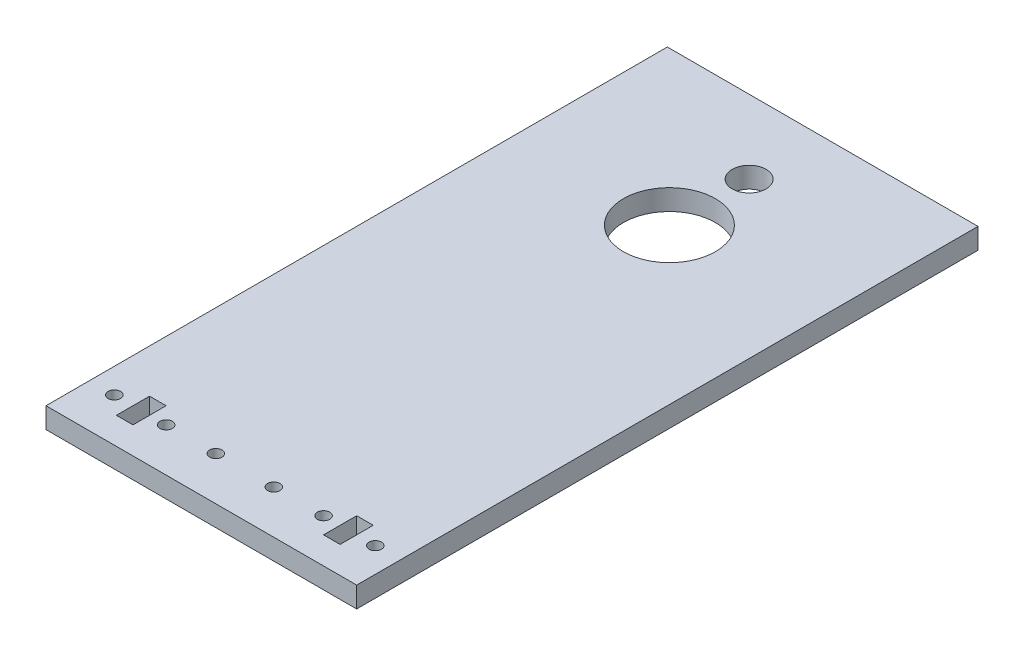
ISO-10303-21;
HEADER;
FILE_DESCRIPTION(('STEP AP214'),'2;1');
FILE_NAME('part.step','',(''),(''),'','','');
FILE_SCHEMA(('AUTOMOTIVE_DESIGN { 1 0 10303 214 1 1 1 1 }'));
ENDSEC;
DATA;
#1=APPLICATION_CONTEXT('core data for automotive mechanical design processes');
#2=APPLICATION_PROTOCOL_DEFINITION('international standard','automotive_design',2000,#1);
#3=PRODUCT_CONTEXT('',#1,'mechanical');
#4=PRODUCT('Part','Part','',(#3));
#5=PRODUCT_RELATED_PRODUCT_CATEGORY('part','',(#4));
#6=PRODUCT_DEFINITION_FORMATION('','',#4);
#7=PRODUCT_DEFINITION_CONTEXT('part definition',#1,'design');
#8=PRODUCT_DEFINITION('design','',#6,#7);
#9=PRODUCT_DEFINITION_SHAPE('','',#8);
#10=(LENGTH_UNIT() NAMED_UNIT(*) SI_UNIT(.MILLI.,.METRE.));
#11=(NAMED_UNIT(*) PLANE_ANGLE_UNIT() SI_UNIT($,.RADIAN.));
#12=(NAMED_UNIT(*) SI_UNIT($,.STERADIAN.) SOLID_ANGLE_UNIT());
#13=UNCERTAINTY_MEASURE_WITH_UNIT(LENGTH_MEASURE(1.E-05),#10,'distance_accuracy_value','');
#14=(GEOMETRIC_REPRESENTATION_CONTEXT(3) GLOBAL_UNCERTAINTY_ASSIGNED_CONTEXT((#13)) GLOBAL_UNIT_ASSIGNED_CONTEXT((#10,
#11,#12)) REPRESENTATION_CONTEXT('',''));
#15=CARTESIAN_POINT('',(0.,0.,0.));
#16=DIRECTION('',(0.,0.,1.));
#17=DIRECTION('',(1.,0.,0.));
#18=AXIS2_PLACEMENT_3D('',#15,#16,#17);
#19=CARTESIAN_POINT('',(10.5,5.,0.));
#20=DIRECTION('',(-1.,0.,0.));
#21=DIRECTION('',(0.,0.,1.));
#22=AXIS2_PLACEMENT_3D('',#19,#20,#21);
#23=PLANE('',#22);
#24=DIRECTION('',(0.,0.,-1.));
#25=VECTOR('',#24,1.);
#26=CARTESIAN_POINT('',(10.5,0.,0.));
#27=LINE('',#26,#25);
#28=CARTESIAN_POINT('',(10.5,0.,-6.50000000000001));
#29=VERTEX_POINT('',#28);
#30=CARTESIAN_POINT('',(10.5,0.,-14.5));
#31=VERTEX_POINT('',#30);
#32=EDGE_CURVE('E229',#29,#31,#27,.T.);
#33=ORIENTED_EDGE('',*,*,#32,.T.);
#34=DIRECTION('',(0.,-1.,0.));
#35=VECTOR('',#34,1.);
#36=CARTESIAN_POINT('',(10.5,5.,-14.5));
#37=LINE('',#36,#35);
#38=CARTESIAN_POINT('',(10.5,5.,-14.5));
#39=VERTEX_POINT('',#38);
#40=EDGE_CURVE('E11',#39,#31,#37,.T.);
#41=ORIENTED_EDGE('',*,*,#40,.F.);
#42=DIRECTION('',(0.,0.,-1.));
#43=VECTOR('',#42,1.);
#44=CARTESIAN_POINT('',(10.5,5.,0.));
#45=LINE('',#44,#43);
#46=CARTESIAN_POINT('',(10.5,5.,-6.50000000000001));
#47=VERTEX_POINT('',#46);
#48=EDGE_CURVE('E148',#47,#39,#45,.T.);
#49=ORIENTED_EDGE('',*,*,#48,.F.);
#50=DIRECTION('',(0.,-1.,0.));
#51=VECTOR('',#50,1.);
#52=CARTESIAN_POINT('',(10.5,5.,-6.50000000000001));
#53=LINE('',#52,#51);
#54=EDGE_CURVE('E247',#47,#29,#53,.T.);
#55=ORIENTED_EDGE('',*,*,#54,.T.);
#56=EDGE_LOOP('',(#33,#41,#49,#55));
#57=FACE_BOUND('',#56,.T.);
#58=ADVANCED_FACE('F40',(#57),#23,.F.);
#59=CARTESIAN_POINT('',(0.,5.,-14.5));
#60=DIRECTION('',(0.,0.,-1.));
#61=DIRECTION('',(-1.,0.,0.));
#62=AXIS2_PLACEMENT_3D('',#59,#60,#61);
#63=PLANE('',#62);
#64=DIRECTION('',(1.,0.,0.));
#65=VECTOR('',#64,1.);
#66=CARTESIAN_POINT('',(0.,0.,-14.5));
#67=LINE('',#66,#65);
#68=CARTESIAN_POINT('',(14.5,0.,-14.5));
#69=VERTEX_POINT('',#68);
#70=EDGE_CURVE('E154',#31,#69,#67,.T.);
#71=ORIENTED_EDGE('',*,*,#70,.T.);
#72=DIRECTION('',(0.,-1.,0.));
#73=VECTOR('',#72,1.);
#74=CARTESIAN_POINT('',(14.5,5.,-14.5));
#75=LINE('',#74,#73);
#76=CARTESIAN_POINT('',(14.5,5.,-14.5));
#77=VERTEX_POINT('',#76);
#78=EDGE_CURVE('E51',#77,#69,#75,.T.);
#79=ORIENTED_EDGE('',*,*,#78,.F.);
#80=DIRECTION('',(1.,0.,0.));
#81=VECTOR('',#80,1.);
#82=CARTESIAN_POINT('',(0.,5.,-14.5));
#83=LINE('',#82,#81);
#84=EDGE_CURVE('E141',#39,#77,#83,.T.);
#85=ORIENTED_EDGE('',*,*,#84,.F.);
#86=ORIENTED_EDGE('',*,*,#40,.T.);
#87=EDGE_LOOP('',(#71,#79,#85,#86));
#88=FACE_BOUND('',#87,.T.);
#89=ADVANCED_FACE('F153',(#88),#63,.F.);
#90=CARTESIAN_POINT('',(14.5,5.,0.));
#91=DIRECTION('',(1.,0.,0.));
#92=DIRECTION('',(0.,0.,-1.));
#93=AXIS2_PLACEMENT_3D('',#90,#91,#92);
#94=PLANE('',#93);
#95=DIRECTION('',(0.,0.,1.));
#96=VECTOR('',#95,1.);
#97=CARTESIAN_POINT('',(14.5,0.,0.));
#98=LINE('',#97,#96);
#99=CARTESIAN_POINT('',(14.5,0.,-6.50000000000001));
#100=VERTEX_POINT('',#99);
#101=EDGE_CURVE('E101',#69,#100,#98,.T.);
#102=ORIENTED_EDGE('',*,*,#101,.T.);
#103=DIRECTION('',(0.,-1.,0.));
#104=VECTOR('',#103,1.);
#105=CARTESIAN_POINT('',(14.5,5.,-6.50000000000001));
#106=LINE('',#105,#104);
#107=CARTESIAN_POINT('',(14.5,5.,-6.50000000000001));
#108=VERTEX_POINT('',#107);
#109=EDGE_CURVE('E156',#108,#100,#106,.T.);
#110=ORIENTED_EDGE('',*,*,#109,.F.);
#111=DIRECTION('',(0.,0.,1.));
#112=VECTOR('',#111,1.);
#113=CARTESIAN_POINT('',(14.5,5.,0.));
#114=LINE('',#113,#112);
#115=EDGE_CURVE('E146',#77,#108,#114,.T.);
#116=ORIENTED_EDGE('',*,*,#115,.F.);
#117=ORIENTED_EDGE('',*,*,#78,.T.);
#118=EDGE_LOOP('',(#102,#110,#116,#117));
#119=FACE_BOUND('',#118,.T.);
#120=ADVANCED_FACE('F158',(#119),#94,.F.);
#121=CARTESIAN_POINT('',(64.5,5.,0.));
#122=DIRECTION('',(-1.,0.,0.));
#123=DIRECTION('',(0.,0.,1.));
#124=AXIS2_PLACEMENT_3D('',#121,#122,#123);
#125=PLANE('',#124);
#126=DIRECTION('',(0.,0.,-1.));
#127=VECTOR('',#126,1.);
#128=CARTESIAN_POINT('',(64.5,0.,0.));
#129=LINE('',#128,#127);
#130=CARTESIAN_POINT('',(64.5,0.,-6.50000000000002));
#131=VERTEX_POINT('',#130);
#132=CARTESIAN_POINT('',(64.5,0.,-14.5));
#133=VERTEX_POINT('',#132);
#134=EDGE_CURVE('E197',#131,#133,#129,.T.);
#135=ORIENTED_EDGE('',*,*,#134,.F.);
#136=DIRECTION('',(0.,-1.,0.));
#137=VECTOR('',#136,1.);
#138=CARTESIAN_POINT('',(64.5,5.,-6.50000000000002));
#139=LINE('',#138,#137);
#140=CARTESIAN_POINT('',(64.5,5.,-6.50000000000002));
#141=VERTEX_POINT('',#140);
#142=EDGE_CURVE('E250',#141,#131,#139,.T.);
#143=ORIENTED_EDGE('',*,*,#142,.F.);
#144=DIRECTION('',(0.,0.,-1.));
#145=VECTOR('',#144,1.);
#146=CARTESIAN_POINT('',(64.5,5.,0.));
#147=LINE('',#146,#145);
#148=CARTESIAN_POINT('',(64.5,5.,-14.5));
#149=VERTEX_POINT('',#148);
#150=EDGE_CURVE('E309',#141,#149,#147,.T.);
#151=ORIENTED_EDGE('',*,*,#150,.T.);
#152=DIRECTION('',(0.,-1.,0.));
#153=VECTOR('',#152,1.);
#154=CARTESIAN_POINT('',(64.5,5.,-14.5));
#155=LINE('',#154,#153);
#156=EDGE_CURVE('E253',#149,#133,#155,.T.);
#157=ORIENTED_EDGE('',*,*,#156,.T.);
#158=EDGE_LOOP('',(#135,#143,#151,#157));
#159=FACE_BOUND('',#158,.T.);
#160=ADVANCED_FACE('F422',(#159),#125,.T.);
#161=CARTESIAN_POINT('',(0.,5.,-6.50000000000002));
#162=DIRECTION('',(0.,0.,-1.));
#163=DIRECTION('',(-1.,0.,0.));
#164=AXIS2_PLACEMENT_3D('',#161,#162,#163);
#165=PLANE('',#164);
#166=DIRECTION('',(1.,0.,0.));
#167=VECTOR('',#166,1.);
#168=CARTESIAN_POINT('',(0.,0.,-6.50000000000002));
#169=LINE('',#168,#167);
#170=CARTESIAN_POINT('',(60.5,0.,-6.50000000000002));
#171=VERTEX_POINT('',#170);
#172=EDGE_CURVE('E201',#171,#131,#169,.T.);
#173=ORIENTED_EDGE('',*,*,#172,.F.);
#174=DIRECTION('',(0.,-1.,0.));
#175=VECTOR('',#174,1.);
#176=CARTESIAN_POINT('',(60.5,5.,-6.50000000000002));
#177=LINE('',#176,#175);
#178=CARTESIAN_POINT('',(60.5,5.,-6.50000000000002));
#179=VERTEX_POINT('',#178);
#180=EDGE_CURVE('E259',#179,#171,#177,.T.);
#181=ORIENTED_EDGE('',*,*,#180,.F.);
#182=DIRECTION('',(1.,0.,0.));
#183=VECTOR('',#182,1.);
#184=CARTESIAN_POINT('',(0.,5.,-6.50000000000002));
#185=LINE('',#184,#183);
#186=EDGE_CURVE('E313',#179,#141,#185,.T.);
#187=ORIENTED_EDGE('',*,*,#186,.T.);
#188=ORIENTED_EDGE('',*,*,#142,.T.);
#189=EDGE_LOOP('',(#173,#181,#187,#188));
#190=FACE_BOUND('',#189,.T.);
#191=ADVANCED_FACE('F418',(#190),#165,.T.);
#192=CARTESIAN_POINT('',(60.5,5.,0.));
#193=DIRECTION('',(1.,0.,0.));
#194=DIRECTION('',(0.,0.,-1.));
#195=AXIS2_PLACEMENT_3D('',#192,#193,#194);
#196=PLANE('',#195);
#197=DIRECTION('',(0.,0.,1.));
#198=VECTOR('',#197,1.);
#199=CARTESIAN_POINT('',(60.5,0.,0.));
#200=LINE('',#199,#198);
#201=CARTESIAN_POINT('',(60.5,0.,-14.5));
#202=VERTEX_POINT('',#201);
#203=EDGE_CURVE('E205',#202,#171,#200,.T.);
#204=ORIENTED_EDGE('',*,*,#203,.F.);
#205=DIRECTION('',(0.,-1.,0.));
#206=VECTOR('',#205,1.);
#207=CARTESIAN_POINT('',(60.5,5.,-14.5));
#208=LINE('',#207,#206);
#209=CARTESIAN_POINT('',(60.5,5.,-14.5));
#210=VERTEX_POINT('',#209);
#211=EDGE_CURVE('E256',#210,#202,#208,.T.);
#212=ORIENTED_EDGE('',*,*,#211,.F.);
#213=DIRECTION('',(0.,0.,1.));
#214=VECTOR('',#213,1.);
#215=CARTESIAN_POINT('',(60.5,5.,0.));
#216=LINE('',#215,#214);
#217=EDGE_CURVE('E317',#210,#179,#216,.T.);
#218=ORIENTED_EDGE('',*,*,#217,.T.);
#219=ORIENTED_EDGE('',*,*,#180,.T.);
#220=EDGE_LOOP('',(#204,#212,#218,#219));
#221=FACE_BOUND('',#220,.T.);
#222=ADVANCED_FACE('F415',(#221),#196,.T.);
#223=CARTESIAN_POINT('',(0.,5.,0.));
#224=DIRECTION('',(0.,0.,-1.));
#225=DIRECTION('',(-1.,0.,0.));
#226=AXIS2_PLACEMENT_3D('',#223,#224,#225);
#227=PLANE('',#226);
#228=DIRECTION('',(1.,0.,0.));
#229=VECTOR('',#228,1.);
#230=CARTESIAN_POINT('',(0.,0.,0.));
#231=LINE('',#230,#229);
#232=CARTESIAN_POINT('',(0.,0.,0.));
#233=VERTEX_POINT('',#232);
#234=CARTESIAN_POINT('',(75.,0.,0.));
#235=VERTEX_POINT('',#234);
#236=EDGE_CURVE('E176',#233,#235,#231,.T.);
#237=ORIENTED_EDGE('',*,*,#236,.T.);
#238=DIRECTION('',(0.,-1.,0.));
#239=VECTOR('',#238,1.);
#240=CARTESIAN_POINT('',(75.,5.,0.));
#241=LINE('',#240,#239);
#242=CARTESIAN_POINT('',(75.,5.,0.));
#243=VERTEX_POINT('',#242);
#244=EDGE_CURVE('E44',#243,#235,#241,.T.);
#245=ORIENTED_EDGE('',*,*,#244,.F.);
#246=DIRECTION('',(1.,0.,0.));
#247=VECTOR('',#246,1.);
#248=CARTESIAN_POINT('',(0.,5.,0.));
#249=LINE('',#248,#247);
#250=CARTESIAN_POINT('',(0.,5.,0.));
#251=VERTEX_POINT('',#250);
#252=EDGE_CURVE('E246',#251,#243,#249,.T.);
#253=ORIENTED_EDGE('',*,*,#252,.F.);
#254=DIRECTION('',(0.,-1.,0.));
#255=VECTOR('',#254,1.);
#256=CARTESIAN_POINT('',(0.,5.,0.));
#257=LINE('',#256,#255);
#258=EDGE_CURVE('E175',#251,#233,#257,.T.);
#259=ORIENTED_EDGE('',*,*,#258,.T.);
#260=EDGE_LOOP('',(#237,#245,#253,#259));
#261=FACE_BOUND('',#260,.T.);
#262=ADVANCED_FACE('F42',(#261),#227,.F.);
#263=CARTESIAN_POINT('',(75.,5.,0.));
#264=DIRECTION('',(-1.,0.,0.));
#265=DIRECTION('',(0.,0.,1.));
#266=AXIS2_PLACEMENT_3D('',#263,#264,#265);
#267=PLANE('',#266);
#268=DIRECTION('',(0.,0.,-1.));
#269=VECTOR('',#268,1.);
#270=CARTESIAN_POINT('',(75.,0.,0.));
#271=LINE('',#270,#269);
#272=CARTESIAN_POINT('',(75.,0.,-150.));
#273=VERTEX_POINT('',#272);
#274=EDGE_CURVE('E180',#235,#273,#271,.T.);
#275=ORIENTED_EDGE('',*,*,#274,.T.);
#276=DIRECTION('',(0.,-1.,0.));
#277=VECTOR('',#276,1.);
#278=CARTESIAN_POINT('',(75.,5.,-150.));
#279=LINE('',#278,#277);
#280=CARTESIAN_POINT('',(75.,5.,-150.));
#281=VERTEX_POINT('',#280);
#282=EDGE_CURVE('E270',#281,#273,#279,.T.);
#283=ORIENTED_EDGE('',*,*,#282,.F.);
#284=DIRECTION('',(0.,0.,-1.));
#285=VECTOR('',#284,1.);
#286=CARTESIAN_POINT('',(75.,5.,0.));
#287=LINE('',#286,#285);
#288=EDGE_CURVE('E116',#243,#281,#287,.T.);
#289=ORIENTED_EDGE('',*,*,#288,.F.);
#290=ORIENTED_EDGE('',*,*,#244,.T.);
#291=EDGE_LOOP('',(#275,#283,#289,#290));
#292=FACE_BOUND('',#291,.T.);
#293=ADVANCED_FACE('F277',(#292),#267,.F.);
#294=CARTESIAN_POINT('',(0.,5.,-150.));
#295=DIRECTION('',(0.,0.,1.));
#296=DIRECTION('',(1.,0.,0.));
#297=AXIS2_PLACEMENT_3D('',#294,#295,#296);
#298=PLANE('',#297);
#299=DIRECTION('',(-1.,0.,0.));
#300=VECTOR('',#299,1.);
#301=CARTESIAN_POINT('',(0.,0.,-150.));
#302=LINE('',#301,#300);
#303=CARTESIAN_POINT('',(0.,0.,-150.));
#304=VERTEX_POINT('',#303);
#305=EDGE_CURVE('E183',#273,#304,#302,.T.);
#306=ORIENTED_EDGE('',*,*,#305,.T.);
#307=DIRECTION('',(0.,-1.,0.));
#308=VECTOR('',#307,1.);
#309=CARTESIAN_POINT('',(0.,5.,-150.));
#310=LINE('',#309,#308);
#311=CARTESIAN_POINT('',(0.,5.,-150.));
#312=VERTEX_POINT('',#311);
#313=EDGE_CURVE('E267',#312,#304,#310,.T.);
#314=ORIENTED_EDGE('',*,*,#313,.F.);
#315=DIRECTION('',(-1.,0.,0.));
#316=VECTOR('',#315,1.);
#317=CARTESIAN_POINT('',(0.,5.,-150.));
#318=LINE('',#317,#316);
#319=EDGE_CURVE('E295',#281,#312,#318,.T.);
#320=ORIENTED_EDGE('',*,*,#319,.F.);
#321=ORIENTED_EDGE('',*,*,#282,.T.);
#322=EDGE_LOOP('',(#306,#314,#320,#321));
#323=FACE_BOUND('',#322,.T.);
#324=ADVANCED_FACE('F287',(#323),#298,.F.);
#325=CARTESIAN_POINT('',(30.5,5.,-10.5));
#326=DIRECTION('',(0.,-1.,0.));
#327=DIRECTION('',(0.,0.,-1.));
#328=AXIS2_PLACEMENT_3D('',#325,#326,#327);
#329=CYLINDRICAL_SURFACE('',#328,1.5);
#330=CARTESIAN_POINT('',(30.5,5.,-10.5));
#331=DIRECTION('',(0.,1.,0.));
#332=DIRECTION('',(0.,0.,1.));
#333=AXIS2_PLACEMENT_3D('',#330,#331,#332);
#334=CIRCLE('',#333,1.5);
#335=CARTESIAN_POINT('',(30.5,5.,-9.00000000000001));
#336=VERTEX_POINT('',#335);
#337=EDGE_CURVE('E164',#336,#336,#334,.F.);
#338=ORIENTED_EDGE('',*,*,#337,.F.);
#339=EDGE_LOOP('',(#338));
#340=FACE_BOUND('',#339,.T.);
#341=CARTESIAN_POINT('',(30.5,0.,-10.5));
#342=DIRECTION('',(0.,1.,0.));
#343=DIRECTION('',(0.,0.,1.));
#344=AXIS2_PLACEMENT_3D('',#341,#342,#343);
#345=CIRCLE('',#344,1.5);
#346=CARTESIAN_POINT('',(30.5,0.,-9.00000000000001));
#347=VERTEX_POINT('',#346);
#348=EDGE_CURVE('E238',#347,#347,#345,.F.);
#349=ORIENTED_EDGE('',*,*,#348,.T.);
#350=EDGE_LOOP('',(#349));
#351=FACE_BOUND('',#350,.T.);
#352=ADVANCED_FACE('F434',(#340,#351),#329,.F.);
#353=CARTESIAN_POINT('',(0.,5.,-6.50000000000001));
#354=DIRECTION('',(0.,0.,1.));
#355=DIRECTION('',(1.,0.,0.));
#356=AXIS2_PLACEMENT_3D('',#353,#354,#355);
#357=PLANE('',#356);
#358=DIRECTION('',(-1.,0.,0.));
#359=VECTOR('',#358,1.);
#360=CARTESIAN_POINT('',(0.,0.,-6.50000000000001));
#361=LINE('',#360,#359);
#362=EDGE_CURVE('E107',#100,#29,#361,.T.);
#363=ORIENTED_EDGE('',*,*,#362,.T.);
#364=ORIENTED_EDGE('',*,*,#54,.F.);
#365=DIRECTION('',(-1.,0.,0.));
#366=VECTOR('',#365,1.);
#367=CARTESIAN_POINT('',(0.,5.,-6.50000000000001));
#368=LINE('',#367,#366);
#369=EDGE_CURVE('E60',#108,#47,#368,.T.);
#370=ORIENTED_EDGE('',*,*,#369,.F.);
#371=ORIENTED_EDGE('',*,*,#109,.T.);
#372=EDGE_LOOP('',(#363,#364,#370,#371));
#373=FACE_BOUND('',#372,.T.);
#374=ADVANCED_FACE('F367',(#373),#357,.F.);
#375=CARTESIAN_POINT('',(18.5,5.,-10.5));
#376=DIRECTION('',(0.,-1.,0.));
#377=DIRECTION('',(0.,0.,-1.));
#378=AXIS2_PLACEMENT_3D('',#375,#376,#377);
#379=CYLINDRICAL_SURFACE('',#378,1.5);
#380=CARTESIAN_POINT('',(18.5,5.,-10.5));
#381=DIRECTION('',(0.,1.,0.));
#382=DIRECTION('',(0.,0.,1.));
#383=AXIS2_PLACEMENT_3D('',#380,#381,#382);
#384=CIRCLE('',#383,1.5);
#385=CARTESIAN_POINT('',(18.5,5.,-9.00000000000001));
#386=VERTEX_POINT('',#385);
#387=EDGE_CURVE('E336',#386,#386,#384,.F.);
#388=ORIENTED_EDGE('',*,*,#387,.F.);
#389=EDGE_LOOP('',(#388));
#390=FACE_BOUND('',#389,.T.);
#391=CARTESIAN_POINT('',(18.5,0.,-10.5));
#392=DIRECTION('',(0.,1.,0.));
#393=DIRECTION('',(0.,0.,1.));
#394=AXIS2_PLACEMENT_3D('',#391,#392,#393);
#395=CIRCLE('',#394,1.5);
#396=CARTESIAN_POINT('',(18.5,0.,-9.00000000000001));
#397=VERTEX_POINT('',#396);
#398=EDGE_CURVE('E225',#397,#397,#395,.F.);
#399=ORIENTED_EDGE('',*,*,#398,.T.);
#400=EDGE_LOOP('',(#399));
#401=FACE_BOUND('',#400,.T.);
#402=ADVANCED_FACE('F363',(#390,#401),#379,.F.);
#403=CARTESIAN_POINT('',(69.,5.,-10.5));
#404=DIRECTION('',(0.,-1.,0.));
#405=DIRECTION('',(0.,0.,-1.));
#406=AXIS2_PLACEMENT_3D('',#403,#404,#405);
#407=CYLINDRICAL_SURFACE('',#406,1.5);
#408=CARTESIAN_POINT('',(69.,5.,-10.5));
#409=DIRECTION('',(0.,1.,0.));
#410=DIRECTION('',(0.,0.,1.));
#411=AXIS2_PLACEMENT_3D('',#408,#409,#410);
#412=CIRCLE('',#411,1.5);
#413=CARTESIAN_POINT('',(69.,5.,-9.00000000000002));
#414=VERTEX_POINT('',#413);
#415=EDGE_CURVE('E332',#414,#414,#412,.T.);
#416=ORIENTED_EDGE('',*,*,#415,.T.);
#417=EDGE_LOOP('',(#416));
#418=FACE_BOUND('',#417,.T.);
#419=CARTESIAN_POINT('',(69.,0.,-10.5));
#420=DIRECTION('',(0.,1.,0.));
#421=DIRECTION('',(0.,0.,1.));
#422=AXIS2_PLACEMENT_3D('',#419,#420,#421);
#423=CIRCLE('',#422,1.5);
#424=CARTESIAN_POINT('',(69.,0.,-9.00000000000002));
#425=VERTEX_POINT('',#424);
#426=EDGE_CURVE('E221',#425,#425,#423,.T.);
#427=ORIENTED_EDGE('',*,*,#426,.F.);
#428=EDGE_LOOP('',(#427));
#429=FACE_BOUND('',#428,.T.);
#430=ADVANCED_FACE('F366',(#418,#429),#407,.F.);
#431=CARTESIAN_POINT('',(37.5,5.,-132.25));
#432=DIRECTION('',(0.,-1.,0.));
#433=DIRECTION('',(0.,0.,-1.));
#434=AXIS2_PLACEMENT_3D('',#431,#432,#433);
#435=CYLINDRICAL_SURFACE('',#434,4.1);
#436=CARTESIAN_POINT('',(37.5,5.,-132.25));
#437=DIRECTION('',(0.,1.,0.));
#438=DIRECTION('',(0.,0.,1.));
#439=AXIS2_PLACEMENT_3D('',#436,#437,#438);
#440=CIRCLE('',#439,4.1);
#441=CARTESIAN_POINT('',(37.5,5.,-128.15));
#442=VERTEX_POINT('',#441);
#443=EDGE_CURVE('E329',#442,#442,#440,.T.);
#444=ORIENTED_EDGE('',*,*,#443,.T.);
#445=EDGE_LOOP('',(#444));
#446=FACE_BOUND('',#445,.T.);
#447=CARTESIAN_POINT('',(37.5,0.,-132.25));
#448=DIRECTION('',(0.,1.,0.));
#449=DIRECTION('',(0.,0.,1.));
#450=AXIS2_PLACEMENT_3D('',#447,#448,#449);
#451=CIRCLE('',#450,4.1);
#452=CARTESIAN_POINT('',(37.5,0.,-128.15));
#453=VERTEX_POINT('',#452);
#454=EDGE_CURVE('E217',#453,#453,#451,.T.);
#455=ORIENTED_EDGE('',*,*,#454,.F.);
#456=EDGE_LOOP('',(#455));
#457=FACE_BOUND('',#456,.T.);
#458=ADVANCED_FACE('F401',(#446,#457),#435,.F.);
#459=CARTESIAN_POINT('',(37.5,5.,-113.));
#460=DIRECTION('',(0.,-1.,0.));
#461=DIRECTION('',(0.,0.,-1.));
#462=AXIS2_PLACEMENT_3D('',#459,#460,#461);
#463=CYLINDRICAL_SURFACE('',#462,11.1);
#464=CARTESIAN_POINT('',(37.5,5.,-113.));
#465=DIRECTION('',(0.,1.,0.));
#466=DIRECTION('',(0.,0.,1.));
#467=AXIS2_PLACEMENT_3D('',#464,#465,#466);
#468=CIRCLE('',#467,11.1);
#469=CARTESIAN_POINT('',(37.5,5.,-101.9));
#470=VERTEX_POINT('',#469);
#471=EDGE_CURVE('E325',#470,#470,#468,.T.);
#472=ORIENTED_EDGE('',*,*,#471,.T.);
#473=EDGE_LOOP('',(#472));
#474=FACE_BOUND('',#473,.T.);
#475=CARTESIAN_POINT('',(37.5,0.,-113.));
#476=DIRECTION('',(0.,1.,0.));
#477=DIRECTION('',(0.,0.,1.));
#478=AXIS2_PLACEMENT_3D('',#475,#476,#477);
#479=CIRCLE('',#478,11.1);
#480=CARTESIAN_POINT('',(37.5,0.,-101.9));
#481=VERTEX_POINT('',#480);
#482=EDGE_CURVE('E213',#481,#481,#479,.T.);
#483=ORIENTED_EDGE('',*,*,#482,.F.);
#484=EDGE_LOOP('',(#483));
#485=FACE_BOUND('',#484,.T.);
#486=ADVANCED_FACE('F405',(#474,#485),#463,.F.);
#487=CARTESIAN_POINT('',(0.,5.,-14.4999999999998));
#488=DIRECTION('',(0.,0.,1.));
#489=DIRECTION('',(1.,0.,0.));
#490=AXIS2_PLACEMENT_3D('',#487,#488,#489);
#491=PLANE('',#490);
#492=DIRECTION('',(-1.,0.,0.));
#493=VECTOR('',#492,1.);
#494=CARTESIAN_POINT('',(0.,0.,-14.4999999999998));
#495=LINE('',#494,#493);
#496=EDGE_CURVE('E209',#133,#202,#495,.T.);
#497=ORIENTED_EDGE('',*,*,#496,.F.);
#498=ORIENTED_EDGE('',*,*,#156,.F.);
#499=DIRECTION('',(-1.,0.,0.));
#500=VECTOR('',#499,1.);
#501=CARTESIAN_POINT('',(0.,5.,-14.4999999999998));
#502=LINE('',#501,#500);
#503=EDGE_CURVE('E321',#149,#210,#502,.T.);
#504=ORIENTED_EDGE('',*,*,#503,.T.);
#505=ORIENTED_EDGE('',*,*,#211,.T.);
#506=EDGE_LOOP('',(#497,#498,#504,#505));
#507=FACE_BOUND('',#506,.T.);
#508=ADVANCED_FACE('F409',(#507),#491,.T.);
#509=CARTESIAN_POINT('',(56.5,5.,-10.5));
#510=DIRECTION('',(0.,-1.,0.));
#511=DIRECTION('',(0.,0.,-1.));
#512=AXIS2_PLACEMENT_3D('',#509,#510,#511);
#513=CYLINDRICAL_SURFACE('',#512,1.5);
#514=CARTESIAN_POINT('',(56.5,5.,-10.5));
#515=DIRECTION('',(0.,1.,0.));
#516=DIRECTION('',(0.,0.,1.));
#517=AXIS2_PLACEMENT_3D('',#514,#515,#516);
#518=CIRCLE('',#517,1.5);
#519=CARTESIAN_POINT('',(56.5,5.,-9.00000000000001));
#520=VERTEX_POINT('',#519);
#521=EDGE_CURVE('E300',#520,#520,#518,.T.);
#522=ORIENTED_EDGE('',*,*,#521,.T.);
#523=EDGE_LOOP('',(#522));
#524=FACE_BOUND('',#523,.T.);
#525=CARTESIAN_POINT('',(56.5,0.,-10.5));
#526=DIRECTION('',(0.,1.,0.));
#527=DIRECTION('',(0.,0.,1.));
#528=AXIS2_PLACEMENT_3D('',#525,#526,#527);
#529=CIRCLE('',#528,1.5);
#530=CARTESIAN_POINT('',(56.5,0.,-9.00000000000001));
#531=VERTEX_POINT('',#530);
#532=EDGE_CURVE('E193',#531,#531,#529,.T.);
#533=ORIENTED_EDGE('',*,*,#532,.F.);
#534=EDGE_LOOP('',(#533));
#535=FACE_BOUND('',#534,.T.);
#536=ADVANCED_FACE('F413',(#524,#535),#513,.F.);
#537=CARTESIAN_POINT('',(44.5,5.,-10.5));
#538=DIRECTION('',(0.,-1.,0.));
#539=DIRECTION('',(0.,0.,-1.));
#540=AXIS2_PLACEMENT_3D('',#537,#538,#539);
#541=CYLINDRICAL_SURFACE('',#540,1.5);
#542=CARTESIAN_POINT('',(44.5,5.,-10.5));
#543=DIRECTION('',(0.,1.,0.));
#544=DIRECTION('',(0.,0.,1.));
#545=AXIS2_PLACEMENT_3D('',#542,#543,#544);
#546=CIRCLE('',#545,1.5);
#547=CARTESIAN_POINT('',(44.5,5.,-9.00000000000001));
#548=VERTEX_POINT('',#547);
#549=EDGE_CURVE('E294',#548,#548,#546,.T.);
#550=ORIENTED_EDGE('',*,*,#549,.T.);
#551=EDGE_LOOP('',(#550));
#552=FACE_BOUND('',#551,.T.);
#553=CARTESIAN_POINT('',(44.5,0.,-10.5));
#554=DIRECTION('',(0.,1.,0.));
#555=DIRECTION('',(0.,0.,1.));
#556=AXIS2_PLACEMENT_3D('',#553,#554,#555);
#557=CIRCLE('',#556,1.5);
#558=CARTESIAN_POINT('',(44.5,0.,-9.00000000000001));
#559=VERTEX_POINT('',#558);
#560=EDGE_CURVE('E189',#559,#559,#557,.T.);
#561=ORIENTED_EDGE('',*,*,#560,.F.);
#562=EDGE_LOOP('',(#561));
#563=FACE_BOUND('',#562,.T.);
#564=ADVANCED_FACE('F386',(#552,#563),#541,.F.);
#565=CARTESIAN_POINT('',(0.,5.,0.));
#566=DIRECTION('',(1.,0.,0.));
#567=DIRECTION('',(0.,0.,-1.));
#568=AXIS2_PLACEMENT_3D('',#565,#566,#567);
#569=PLANE('',#568);
#570=DIRECTION('',(0.,0.,1.));
#571=VECTOR('',#570,1.);
#572=CARTESIAN_POINT('',(0.,0.,0.));
#573=LINE('',#572,#571);
#574=EDGE_CURVE('E186',#304,#233,#573,.T.);
#575=ORIENTED_EDGE('',*,*,#574,.T.);
#576=ORIENTED_EDGE('',*,*,#258,.F.);
#577=DIRECTION('',(0.,0.,1.));
#578=VECTOR('',#577,1.);
#579=CARTESIAN_POINT('',(0.,5.,0.));
#580=LINE('',#579,#578);
#581=EDGE_CURVE('E291',#312,#251,#580,.T.);
#582=ORIENTED_EDGE('',*,*,#581,.F.);
#583=ORIENTED_EDGE('',*,*,#313,.T.);
#584=EDGE_LOOP('',(#575,#576,#582,#583));
#585=FACE_BOUND('',#584,.T.);
#586=ADVANCED_FACE('F290',(#585),#569,.F.);
#587=CARTESIAN_POINT('',(5.99999999999999,5.,-10.5));
#588=DIRECTION('',(0.,-1.,0.));
#589=DIRECTION('',(0.,0.,-1.));
#590=AXIS2_PLACEMENT_3D('',#587,#588,#589);
#591=CYLINDRICAL_SURFACE('',#590,1.5);
#592=CARTESIAN_POINT('',(5.99999999999999,5.,-10.5));
#593=DIRECTION('',(0.,1.,0.));
#594=DIRECTION('',(0.,0.,1.));
#595=AXIS2_PLACEMENT_3D('',#592,#593,#594);
#596=CIRCLE('',#595,1.5);
#597=CARTESIAN_POINT('',(5.99999999999999,5.,-9.00000000000002));
#598=VERTEX_POINT('',#597);
#599=EDGE_CURVE('E171',#598,#598,#596,.F.);
#600=ORIENTED_EDGE('',*,*,#599,.F.);
#601=EDGE_LOOP('',(#600));
#602=FACE_BOUND('',#601,.T.);
#603=CARTESIAN_POINT('',(5.99999999999999,0.,-10.5));
#604=DIRECTION('',(0.,1.,0.));
#605=DIRECTION('',(0.,0.,1.));
#606=AXIS2_PLACEMENT_3D('',#603,#604,#605);
#607=CIRCLE('',#606,1.5);
#608=CARTESIAN_POINT('',(5.99999999999999,0.,-9.00000000000002));
#609=VERTEX_POINT('',#608);
#610=EDGE_CURVE('E242',#609,#609,#607,.F.);
#611=ORIENTED_EDGE('',*,*,#610,.T.);
#612=EDGE_LOOP('',(#611));
#613=FACE_BOUND('',#612,.T.);
#614=ADVANCED_FACE('F345',(#602,#613),#591,.F.);
#615=CARTESIAN_POINT('',(0.,5.,0.));
#616=DIRECTION('',(0.,1.,0.));
#617=DIRECTION('',(0.,0.,1.));
#618=AXIS2_PLACEMENT_3D('',#615,#616,#617);
#619=PLANE('',#618);
#620=ORIENTED_EDGE('',*,*,#252,.T.);
#621=ORIENTED_EDGE('',*,*,#288,.T.);
#622=ORIENTED_EDGE('',*,*,#319,.T.);
#623=ORIENTED_EDGE('',*,*,#581,.T.);
#624=EDGE_LOOP('',(#620,#621,#622,#623));
#625=FACE_BOUND('',#624,.T.);
#626=ORIENTED_EDGE('',*,*,#549,.F.);
#627=EDGE_LOOP('',(#626));
#628=FACE_BOUND('',#627,.T.);
#629=ORIENTED_EDGE('',*,*,#521,.F.);
#630=EDGE_LOOP('',(#629));
#631=FACE_BOUND('',#630,.T.);
#632=ORIENTED_EDGE('',*,*,#150,.F.);
#633=ORIENTED_EDGE('',*,*,#186,.F.);
#634=ORIENTED_EDGE('',*,*,#217,.F.);
#635=ORIENTED_EDGE('',*,*,#503,.F.);
#636=EDGE_LOOP('',(#632,#633,#634,#635));
#637=FACE_BOUND('',#636,.T.);
#638=ORIENTED_EDGE('',*,*,#471,.F.);
#639=EDGE_LOOP('',(#638));
#640=FACE_BOUND('',#639,.T.);
#641=ORIENTED_EDGE('',*,*,#443,.F.);
#642=EDGE_LOOP('',(#641));
#643=FACE_BOUND('',#642,.T.);
#644=ORIENTED_EDGE('',*,*,#415,.F.);
#645=EDGE_LOOP('',(#644));
#646=FACE_BOUND('',#645,.T.);
#647=ORIENTED_EDGE('',*,*,#387,.T.);
#648=EDGE_LOOP('',(#647));
#649=FACE_BOUND('',#648,.T.);
#650=ORIENTED_EDGE('',*,*,#48,.T.);
#651=ORIENTED_EDGE('',*,*,#84,.T.);
#652=ORIENTED_EDGE('',*,*,#115,.T.);
#653=ORIENTED_EDGE('',*,*,#369,.T.);
#654=EDGE_LOOP('',(#650,#651,#652,#653));
#655=FACE_BOUND('',#654,.T.);
#656=ORIENTED_EDGE('',*,*,#337,.T.);
#657=EDGE_LOOP('',(#656));
#658=FACE_BOUND('',#657,.T.);
#659=ORIENTED_EDGE('',*,*,#599,.T.);
#660=EDGE_LOOP('',(#659));
#661=FACE_BOUND('',#660,.T.);
#662=ADVANCED_FACE('F143',(#625,#628,#631,#637,#640,#643,#646,#649,#655,#658,#661),#619,.T.);
#663=CARTESIAN_POINT('',(0.,0.,0.));
#664=DIRECTION('',(0.,1.,0.));
#665=DIRECTION('',(0.,0.,1.));
#666=AXIS2_PLACEMENT_3D('',#663,#664,#665);
#667=PLANE('',#666);
#668=ORIENTED_EDGE('',*,*,#236,.F.);
#669=ORIENTED_EDGE('',*,*,#574,.F.);
#670=ORIENTED_EDGE('',*,*,#305,.F.);
#671=ORIENTED_EDGE('',*,*,#274,.F.);
#672=EDGE_LOOP('',(#668,#669,#670,#671));
#673=FACE_BOUND('',#672,.T.);
#674=ORIENTED_EDGE('',*,*,#560,.T.);
#675=EDGE_LOOP('',(#674));
#676=FACE_BOUND('',#675,.T.);
#677=ORIENTED_EDGE('',*,*,#532,.T.);
#678=EDGE_LOOP('',(#677));
#679=FACE_BOUND('',#678,.T.);
#680=ORIENTED_EDGE('',*,*,#134,.T.);
#681=ORIENTED_EDGE('',*,*,#496,.T.);
#682=ORIENTED_EDGE('',*,*,#203,.T.);
#683=ORIENTED_EDGE('',*,*,#172,.T.);
#684=EDGE_LOOP('',(#680,#681,#682,#683));
#685=FACE_BOUND('',#684,.T.);
#686=ORIENTED_EDGE('',*,*,#482,.T.);
#687=EDGE_LOOP('',(#686));
#688=FACE_BOUND('',#687,.T.);
#689=ORIENTED_EDGE('',*,*,#454,.T.);
#690=EDGE_LOOP('',(#689));
#691=FACE_BOUND('',#690,.T.);
#692=ORIENTED_EDGE('',*,*,#426,.T.);
#693=EDGE_LOOP('',(#692));
#694=FACE_BOUND('',#693,.T.);
#695=ORIENTED_EDGE('',*,*,#398,.F.);
#696=EDGE_LOOP('',(#695));
#697=FACE_BOUND('',#696,.T.);
#698=ORIENTED_EDGE('',*,*,#32,.F.);
#699=ORIENTED_EDGE('',*,*,#362,.F.);
#700=ORIENTED_EDGE('',*,*,#101,.F.);
#701=ORIENTED_EDGE('',*,*,#70,.F.);
#702=EDGE_LOOP('',(#698,#699,#700,#701));
#703=FACE_BOUND('',#702,.T.);
#704=ORIENTED_EDGE('',*,*,#348,.F.);
#705=EDGE_LOOP('',(#704));
#706=FACE_BOUND('',#705,.T.);
#707=ORIENTED_EDGE('',*,*,#610,.F.);
#708=EDGE_LOOP('',(#707));
#709=FACE_BOUND('',#708,.T.);
#710=ADVANCED_FACE('F284',(#673,#676,#679,#685,#688,#691,#694,#697,#703,#706,#709),#667,.F.);
#711=CLOSED_SHELL('',(#58,#89,#120,#160,#191,#222,#262,#293,#324,#352,#374,#402,#430,#458,#486,
#508,#536,#564,#586,#614,#662,#710));
#712=MANIFOLD_SOLID_BREP('B2',#711);
#713=ADVANCED_BREP_SHAPE_REPRESENTATION('',(#18,#712),#14);
#714=SHAPE_DEFINITION_REPRESENTATION(#9,#713);
ENDSEC;
END-ISO-10303-21;
